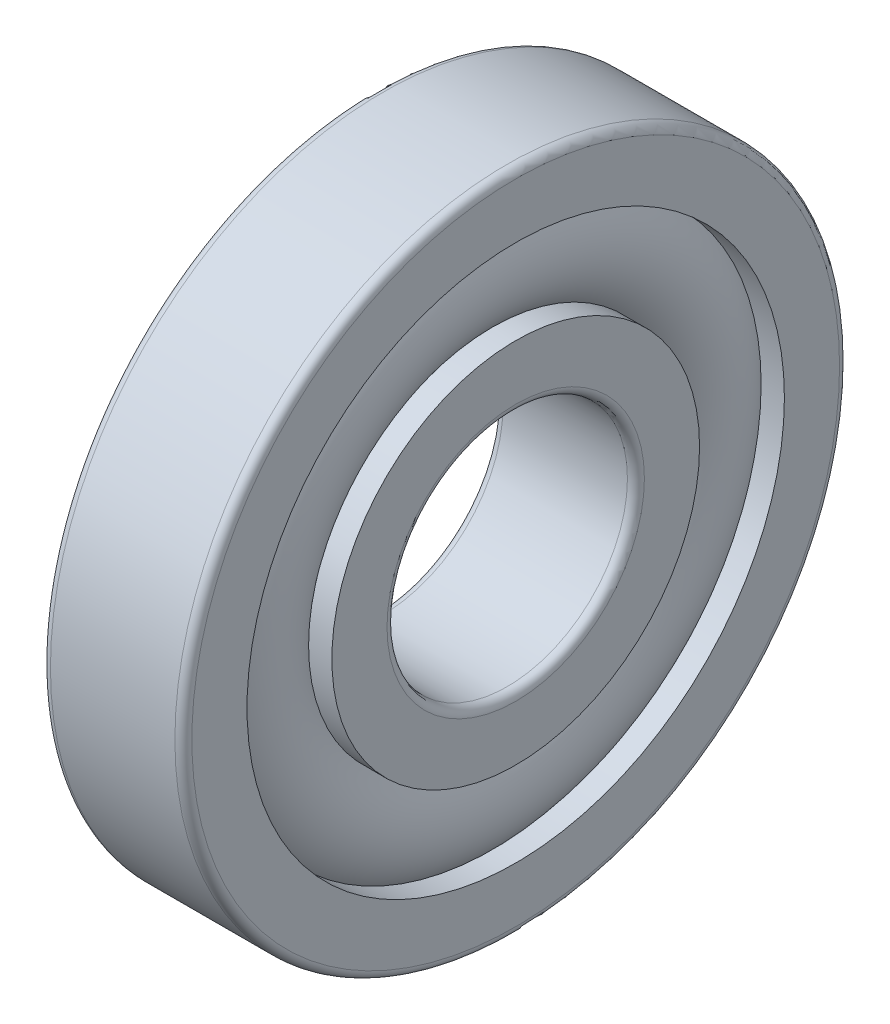
ISO-10303-21;
HEADER;
FILE_DESCRIPTION(('STEP AP214'),'2;1');
FILE_NAME('part.step','',(''),(''),'','','');
FILE_SCHEMA(('AUTOMOTIVE_DESIGN { 1 0 10303 214 1 1 1 1 }'));
ENDSEC;
DATA;
#1=APPLICATION_CONTEXT('core data for automotive mechanical design processes');
#2=APPLICATION_PROTOCOL_DEFINITION('international standard','automotive_design',2000,#1);
#3=PRODUCT_CONTEXT('',#1,'mechanical');
#4=PRODUCT('Part','Part','',(#3));
#5=PRODUCT_RELATED_PRODUCT_CATEGORY('part','',(#4));
#6=PRODUCT_DEFINITION_FORMATION('','',#4);
#7=PRODUCT_DEFINITION_CONTEXT('part definition',#1,'design');
#8=PRODUCT_DEFINITION('design','',#6,#7);
#9=PRODUCT_DEFINITION_SHAPE('','',#8);
#10=(LENGTH_UNIT() NAMED_UNIT(*) SI_UNIT(.MILLI.,.METRE.));
#11=(NAMED_UNIT(*) PLANE_ANGLE_UNIT() SI_UNIT($,.RADIAN.));
#12=(NAMED_UNIT(*) SI_UNIT($,.STERADIAN.) SOLID_ANGLE_UNIT());
#13=UNCERTAINTY_MEASURE_WITH_UNIT(LENGTH_MEASURE(1.E-05),#10,'distance_accuracy_value','');
#14=(GEOMETRIC_REPRESENTATION_CONTEXT(3) GLOBAL_UNCERTAINTY_ASSIGNED_CONTEXT((#13)) GLOBAL_UNIT_ASSIGNED_CONTEXT((#10,
#11,#12)) REPRESENTATION_CONTEXT('',''));
#15=CARTESIAN_POINT('',(0.,0.,0.));
#16=DIRECTION('',(0.,0.,1.));
#17=DIRECTION('',(1.,0.,0.));
#18=AXIS2_PLACEMENT_3D('',#15,#16,#17);
#19=CARTESIAN_POINT('',(0.,0.,0.));
#20=DIRECTION('',(-1.,0.,0.));
#21=DIRECTION('',(0.,0.,1.));
#22=AXIS2_PLACEMENT_3D('',#19,#20,#21);
#23=TOROIDAL_SURFACE('',#22,16.,4.5);
#24=CARTESIAN_POINT('',(3.35410196624968,0.,0.));
#25=DIRECTION('',(-1.,0.,0.));
#26=DIRECTION('',(0.,0.,1.));
#27=AXIS2_PLACEMENT_3D('',#24,#25,#26);
#28=CIRCLE('',#27,19.);
#29=CARTESIAN_POINT('',(3.35410196624968,0.,19.));
#30=VERTEX_POINT('',#29);
#31=EDGE_CURVE('E36',#30,#30,#28,.F.);
#32=ORIENTED_EDGE('',*,*,#31,.T.);
#33=EDGE_LOOP('',(#32));
#34=FACE_BOUND('',#33,.T.);
#35=CARTESIAN_POINT('',(3.35410196624968,0.,0.));
#36=DIRECTION('',(-1.,0.,0.));
#37=DIRECTION('',(0.,0.,1.));
#38=AXIS2_PLACEMENT_3D('',#35,#36,#37);
#39=CIRCLE('',#38,13.);
#40=CARTESIAN_POINT('',(3.35410196624968,0.,13.));
#41=VERTEX_POINT('',#40);
#42=EDGE_CURVE('E10',#41,#41,#39,.T.);
#43=ORIENTED_EDGE('',*,*,#42,.T.);
#44=EDGE_LOOP('',(#43));
#45=FACE_BOUND('',#44,.T.);
#46=ADVANCED_FACE('F32',(#34,#45),#23,.T.);
#47=CARTESIAN_POINT('',(-20.6375,0.,0.));
#48=DIRECTION('',(1.,0.,0.));
#49=DIRECTION('',(0.,0.,-1.));
#50=AXIS2_PLACEMENT_3D('',#47,#48,#49);
#51=CYLINDRICAL_SURFACE('',#50,13.);
#52=CARTESIAN_POINT('',(5.,0.,0.));
#53=DIRECTION('',(1.,0.,0.));
#54=DIRECTION('',(0.,0.,-1.));
#55=AXIS2_PLACEMENT_3D('',#52,#53,#54);
#56=CIRCLE('',#55,13.);
#57=CARTESIAN_POINT('',(5.,0.,-13.));
#58=VERTEX_POINT('',#57);
#59=EDGE_CURVE('E45',#58,#58,#56,.T.);
#60=ORIENTED_EDGE('',*,*,#59,.F.);
#61=EDGE_LOOP('',(#60));
#62=FACE_BOUND('',#61,.T.);
#63=ORIENTED_EDGE('',*,*,#42,.F.);
#64=EDGE_LOOP('',(#63));
#65=FACE_BOUND('',#64,.T.);
#66=ADVANCED_FACE('F84',(#62,#65),#51,.T.);
#67=CARTESIAN_POINT('',(-20.6375,0.,0.));
#68=DIRECTION('',(1.,0.,0.));
#69=DIRECTION('',(0.,0.,-1.));
#70=AXIS2_PLACEMENT_3D('',#67,#68,#69);
#71=CYLINDRICAL_SURFACE('',#70,13.);
#72=CARTESIAN_POINT('',(-5.,0.,0.));
#73=DIRECTION('',(1.,0.,0.));
#74=DIRECTION('',(0.,0.,-1.));
#75=AXIS2_PLACEMENT_3D('',#72,#73,#74);
#76=CIRCLE('',#75,13.);
#77=CARTESIAN_POINT('',(-5.,0.,-13.));
#78=VERTEX_POINT('',#77);
#79=EDGE_CURVE('E54',#78,#78,#76,.T.);
#80=ORIENTED_EDGE('',*,*,#79,.T.);
#81=EDGE_LOOP('',(#80));
#82=FACE_BOUND('',#81,.T.);
#83=CARTESIAN_POINT('',(-3.35410196624968,0.,0.));
#84=DIRECTION('',(1.,0.,0.));
#85=DIRECTION('',(0.,0.,-1.));
#86=AXIS2_PLACEMENT_3D('',#83,#84,#85);
#87=CIRCLE('',#86,13.);
#88=CARTESIAN_POINT('',(-3.35410196624968,0.,-13.));
#89=VERTEX_POINT('',#88);
#90=EDGE_CURVE('E40',#89,#89,#87,.T.);
#91=ORIENTED_EDGE('',*,*,#90,.F.);
#92=EDGE_LOOP('',(#91));
#93=FACE_BOUND('',#92,.T.);
#94=ADVANCED_FACE('F87',(#82,#93),#71,.T.);
#95=CARTESIAN_POINT('',(5.,9.1,0.));
#96=DIRECTION('',(1.,0.,0.));
#97=DIRECTION('',(0.,0.,-1.));
#98=AXIS2_PLACEMENT_3D('',#95,#96,#97);
#99=PLANE('',#98);
#100=ORIENTED_EDGE('',*,*,#59,.T.);
#101=EDGE_LOOP('',(#100));
#102=FACE_BOUND('',#101,.T.);
#103=CARTESIAN_POINT('',(5.,0.,0.));
#104=DIRECTION('',(1.,0.,0.));
#105=DIRECTION('',(0.,0.,-1.));
#106=AXIS2_PLACEMENT_3D('',#103,#104,#105);
#107=CIRCLE('',#106,9.1);
#108=CARTESIAN_POINT('',(5.,0.,-9.1));
#109=VERTEX_POINT('',#108);
#110=EDGE_CURVE('E76',#109,#109,#107,.T.);
#111=ORIENTED_EDGE('',*,*,#110,.F.);
#112=EDGE_LOOP('',(#111));
#113=FACE_BOUND('',#112,.T.);
#114=ADVANCED_FACE('F81',(#102,#113),#99,.T.);
#115=CARTESIAN_POINT('',(4.4,0.,0.));
#116=DIRECTION('',(1.,0.,0.));
#117=DIRECTION('',(0.,0.,-1.));
#118=AXIS2_PLACEMENT_3D('',#115,#116,#117);
#119=TOROIDAL_SURFACE('',#118,9.1,0.599999999999999);
#120=ORIENTED_EDGE('',*,*,#110,.T.);
#121=EDGE_LOOP('',(#120));
#122=FACE_BOUND('',#121,.T.);
#123=CARTESIAN_POINT('',(4.4,0.,0.));
#124=DIRECTION('',(1.,0.,0.));
#125=DIRECTION('',(0.,0.,-1.));
#126=AXIS2_PLACEMENT_3D('',#123,#124,#125);
#127=CIRCLE('',#126,8.5);
#128=CARTESIAN_POINT('',(4.4,0.,-8.5));
#129=VERTEX_POINT('',#128);
#130=EDGE_CURVE('E73',#129,#129,#127,.T.);
#131=ORIENTED_EDGE('',*,*,#130,.F.);
#132=EDGE_LOOP('',(#131));
#133=FACE_BOUND('',#132,.T.);
#134=ADVANCED_FACE('F98',(#122,#133),#119,.T.);
#135=CARTESIAN_POINT('',(-20.6375,0.,0.));
#136=DIRECTION('',(1.,0.,0.));
#137=DIRECTION('',(0.,0.,-1.));
#138=AXIS2_PLACEMENT_3D('',#135,#136,#137);
#139=CYLINDRICAL_SURFACE('',#138,8.5);
#140=ORIENTED_EDGE('',*,*,#130,.T.);
#141=EDGE_LOOP('',(#140));
#142=FACE_BOUND('',#141,.T.);
#143=CARTESIAN_POINT('',(-4.4,0.,0.));
#144=DIRECTION('',(1.,0.,0.));
#145=DIRECTION('',(0.,0.,-1.));
#146=AXIS2_PLACEMENT_3D('',#143,#144,#145);
#147=CIRCLE('',#146,8.5);
#148=CARTESIAN_POINT('',(-4.4,0.,-8.5));
#149=VERTEX_POINT('',#148);
#150=EDGE_CURVE('E70',#149,#149,#147,.T.);
#151=ORIENTED_EDGE('',*,*,#150,.F.);
#152=EDGE_LOOP('',(#151));
#153=FACE_BOUND('',#152,.T.);
#154=ADVANCED_FACE('F101',(#142,#153),#139,.F.);
#155=CARTESIAN_POINT('',(-4.4,0.,0.));
#156=DIRECTION('',(1.,0.,0.));
#157=DIRECTION('',(0.,0.,-1.));
#158=AXIS2_PLACEMENT_3D('',#155,#156,#157);
#159=TOROIDAL_SURFACE('',#158,9.1,0.599999999999999);
#160=ORIENTED_EDGE('',*,*,#150,.T.);
#161=EDGE_LOOP('',(#160));
#162=FACE_BOUND('',#161,.T.);
#163=CARTESIAN_POINT('',(-5.,0.,0.));
#164=DIRECTION('',(1.,0.,0.));
#165=DIRECTION('',(0.,0.,-1.));
#166=AXIS2_PLACEMENT_3D('',#163,#164,#165);
#167=CIRCLE('',#166,9.1);
#168=CARTESIAN_POINT('',(-5.,0.,-9.1));
#169=VERTEX_POINT('',#168);
#170=EDGE_CURVE('E67',#169,#169,#167,.T.);
#171=ORIENTED_EDGE('',*,*,#170,.F.);
#172=EDGE_LOOP('',(#171));
#173=FACE_BOUND('',#172,.T.);
#174=ADVANCED_FACE('F105',(#162,#173),#159,.T.);
#175=CARTESIAN_POINT('',(-5.,13.,0.));
#176=DIRECTION('',(-1.,0.,0.));
#177=DIRECTION('',(0.,0.,1.));
#178=AXIS2_PLACEMENT_3D('',#175,#176,#177);
#179=PLANE('',#178);
#180=ORIENTED_EDGE('',*,*,#170,.T.);
#181=EDGE_LOOP('',(#180));
#182=FACE_BOUND('',#181,.T.);
#183=ORIENTED_EDGE('',*,*,#79,.F.);
#184=EDGE_LOOP('',(#183));
#185=FACE_BOUND('',#184,.T.);
#186=ADVANCED_FACE('F109',(#182,#185),#179,.T.);
#187=CARTESIAN_POINT('',(-3.35410196624968,0.,0.));
#188=DIRECTION('',(1.,0.,0.));
#189=DIRECTION('',(0.,0.,-1.));
#190=AXIS2_PLACEMENT_3D('',#187,#188,#189);
#191=CIRCLE('',#190,19.);
#192=CARTESIAN_POINT('',(-3.35410196624968,0.,-19.));
#193=VERTEX_POINT('',#192);
#194=EDGE_CURVE('E48',#193,#193,#191,.F.);
#195=ORIENTED_EDGE('',*,*,#194,.T.);
#196=EDGE_LOOP('',(#195));
#197=FACE_BOUND('',#196,.T.);
#198=ORIENTED_EDGE('',*,*,#90,.T.);
#199=EDGE_LOOP('',(#198));
#200=FACE_BOUND('',#199,.T.);
#201=ADVANCED_FACE('F34',(#197,#200),#23,.T.);
#202=CARTESIAN_POINT('',(-20.6375,0.,0.));
#203=DIRECTION('',(1.,0.,0.));
#204=DIRECTION('',(0.,0.,-1.));
#205=AXIS2_PLACEMENT_3D('',#202,#203,#204);
#206=CYLINDRICAL_SURFACE('',#205,19.);
#207=CARTESIAN_POINT('',(5.,0.,0.));
#208=DIRECTION('',(1.,0.,0.));
#209=DIRECTION('',(0.,0.,-1.));
#210=AXIS2_PLACEMENT_3D('',#207,#208,#209);
#211=CIRCLE('',#210,19.);
#212=CARTESIAN_POINT('',(5.,0.,-19.));
#213=VERTEX_POINT('',#212);
#214=EDGE_CURVE('E50',#213,#213,#211,.T.);
#215=ORIENTED_EDGE('',*,*,#214,.T.);
#216=EDGE_LOOP('',(#215));
#217=FACE_BOUND('',#216,.T.);
#218=ORIENTED_EDGE('',*,*,#31,.F.);
#219=EDGE_LOOP('',(#218));
#220=FACE_BOUND('',#219,.T.);
#221=ADVANCED_FACE('F114',(#217,#220),#206,.F.);
#222=CARTESIAN_POINT('',(-20.6375,0.,0.));
#223=DIRECTION('',(1.,0.,0.));
#224=DIRECTION('',(0.,0.,-1.));
#225=AXIS2_PLACEMENT_3D('',#222,#223,#224);
#226=CYLINDRICAL_SURFACE('',#225,19.);
#227=CARTESIAN_POINT('',(-5.,0.,0.));
#228=DIRECTION('',(1.,0.,0.));
#229=DIRECTION('',(0.,0.,-1.));
#230=AXIS2_PLACEMENT_3D('',#227,#228,#229);
#231=CIRCLE('',#230,19.);
#232=CARTESIAN_POINT('',(-5.,0.,-19.));
#233=VERTEX_POINT('',#232);
#234=EDGE_CURVE('E145',#233,#233,#231,.T.);
#235=ORIENTED_EDGE('',*,*,#234,.F.);
#236=EDGE_LOOP('',(#235));
#237=FACE_BOUND('',#236,.T.);
#238=ORIENTED_EDGE('',*,*,#194,.F.);
#239=EDGE_LOOP('',(#238));
#240=FACE_BOUND('',#239,.T.);
#241=ADVANCED_FACE('F117',(#237,#240),#226,.F.);
#242=CARTESIAN_POINT('',(5.,22.9,0.));
#243=DIRECTION('',(1.,0.,0.));
#244=DIRECTION('',(0.,0.,-1.));
#245=AXIS2_PLACEMENT_3D('',#242,#243,#244);
#246=PLANE('',#245);
#247=CARTESIAN_POINT('',(5.,0.,0.));
#248=DIRECTION('',(1.,0.,0.));
#249=DIRECTION('',(0.,0.,-1.));
#250=AXIS2_PLACEMENT_3D('',#247,#248,#249);
#251=CIRCLE('',#250,22.9);
#252=CARTESIAN_POINT('',(5.,0.,-22.9));
#253=VERTEX_POINT('',#252);
#254=EDGE_CURVE('E56',#253,#253,#251,.T.);
#255=ORIENTED_EDGE('',*,*,#254,.T.);
#256=EDGE_LOOP('',(#255));
#257=FACE_BOUND('',#256,.T.);
#258=ORIENTED_EDGE('',*,*,#214,.F.);
#259=EDGE_LOOP('',(#258));
#260=FACE_BOUND('',#259,.T.);
#261=ADVANCED_FACE('F118',(#257,#260),#246,.T.);
#262=CARTESIAN_POINT('',(4.4,0.,0.));
#263=DIRECTION('',(1.,0.,0.));
#264=DIRECTION('',(0.,0.,-1.));
#265=AXIS2_PLACEMENT_3D('',#262,#263,#264);
#266=TOROIDAL_SURFACE('',#265,22.9,0.600000000000004);
#267=CARTESIAN_POINT('',(4.4,0.,0.));
#268=DIRECTION('',(1.,0.,0.));
#269=DIRECTION('',(0.,0.,-1.));
#270=AXIS2_PLACEMENT_3D('',#267,#268,#269);
#271=CIRCLE('',#270,23.5);
#272=CARTESIAN_POINT('',(4.4,0.,-23.5));
#273=VERTEX_POINT('',#272);
#274=EDGE_CURVE('E61',#273,#273,#271,.T.);
#275=ORIENTED_EDGE('',*,*,#274,.T.);
#276=EDGE_LOOP('',(#275));
#277=FACE_BOUND('',#276,.T.);
#278=ORIENTED_EDGE('',*,*,#254,.F.);
#279=EDGE_LOOP('',(#278));
#280=FACE_BOUND('',#279,.T.);
#281=ADVANCED_FACE('F121',(#277,#280),#266,.T.);
#282=CARTESIAN_POINT('',(-20.6375,0.,0.));
#283=DIRECTION('',(1.,0.,0.));
#284=DIRECTION('',(0.,0.,-1.));
#285=AXIS2_PLACEMENT_3D('',#282,#283,#284);
#286=CYLINDRICAL_SURFACE('',#285,23.5);
#287=CARTESIAN_POINT('',(-4.4,0.,0.));
#288=DIRECTION('',(1.,0.,0.));
#289=DIRECTION('',(0.,0.,-1.));
#290=AXIS2_PLACEMENT_3D('',#287,#288,#289);
#291=CIRCLE('',#290,23.5);
#292=CARTESIAN_POINT('',(-4.4,0.,-23.5));
#293=VERTEX_POINT('',#292);
#294=EDGE_CURVE('E149',#293,#293,#291,.T.);
#295=ORIENTED_EDGE('',*,*,#294,.T.);
#296=EDGE_LOOP('',(#295));
#297=FACE_BOUND('',#296,.T.);
#298=ORIENTED_EDGE('',*,*,#274,.F.);
#299=EDGE_LOOP('',(#298));
#300=FACE_BOUND('',#299,.T.);
#301=ADVANCED_FACE('F125',(#297,#300),#286,.T.);
#302=CARTESIAN_POINT('',(-4.4,0.,0.));
#303=DIRECTION('',(1.,0.,0.));
#304=DIRECTION('',(0.,0.,-1.));
#305=AXIS2_PLACEMENT_3D('',#302,#303,#304);
#306=TOROIDAL_SURFACE('',#305,22.9,0.600000000000004);
#307=CARTESIAN_POINT('',(-5.,0.,0.));
#308=DIRECTION('',(1.,0.,0.));
#309=DIRECTION('',(0.,0.,-1.));
#310=AXIS2_PLACEMENT_3D('',#307,#308,#309);
#311=CIRCLE('',#310,22.9);
#312=CARTESIAN_POINT('',(-5.,0.,-22.9));
#313=VERTEX_POINT('',#312);
#314=EDGE_CURVE('E146',#313,#313,#311,.T.);
#315=ORIENTED_EDGE('',*,*,#314,.T.);
#316=EDGE_LOOP('',(#315));
#317=FACE_BOUND('',#316,.T.);
#318=ORIENTED_EDGE('',*,*,#294,.F.);
#319=EDGE_LOOP('',(#318));
#320=FACE_BOUND('',#319,.T.);
#321=ADVANCED_FACE('F129',(#317,#320),#306,.T.);
#322=CARTESIAN_POINT('',(-5.,19.,0.));
#323=DIRECTION('',(-1.,0.,0.));
#324=DIRECTION('',(0.,0.,1.));
#325=AXIS2_PLACEMENT_3D('',#322,#323,#324);
#326=PLANE('',#325);
#327=ORIENTED_EDGE('',*,*,#234,.T.);
#328=EDGE_LOOP('',(#327));
#329=FACE_BOUND('',#328,.T.);
#330=ORIENTED_EDGE('',*,*,#314,.F.);
#331=EDGE_LOOP('',(#330));
#332=FACE_BOUND('',#331,.T.);
#333=ADVANCED_FACE('F133',(#329,#332),#326,.T.);
#334=CLOSED_SHELL('',(#46,#66,#94,#114,#134,#154,#174,#186,#201,#221,#241,#261,#281,#301,#321,#333));
#335=MANIFOLD_SOLID_BREP('B2',#334);
#336=ADVANCED_BREP_SHAPE_REPRESENTATION('',(#18,#335),#14);
#337=SHAPE_DEFINITION_REPRESENTATION(#9,#336);
ENDSEC;
END-ISO-10303-21;
